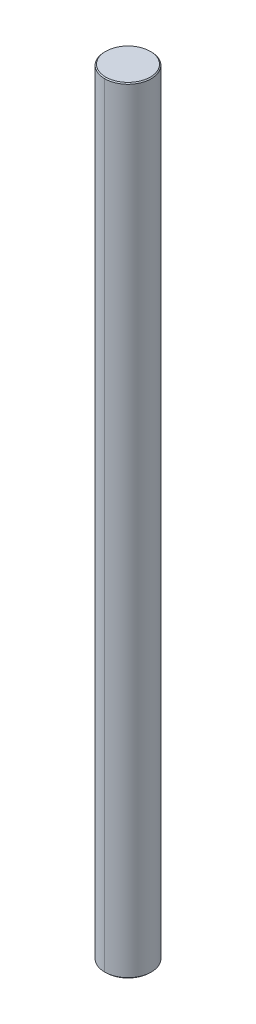
ISO-10303-21;
HEADER;
FILE_DESCRIPTION(('STEP AP214'),'2;1');
FILE_NAME('part.step','',(''),(''),'','','');
FILE_SCHEMA(('AUTOMOTIVE_DESIGN { 1 0 10303 214 1 1 1 1 }'));
ENDSEC;
DATA;
#1=APPLICATION_CONTEXT('core data for automotive mechanical design processes');
#2=APPLICATION_PROTOCOL_DEFINITION('international standard','automotive_design',2000,#1);
#3=PRODUCT_CONTEXT('',#1,'mechanical');
#4=PRODUCT('Part','Part','',(#3));
#5=PRODUCT_RELATED_PRODUCT_CATEGORY('part','',(#4));
#6=PRODUCT_DEFINITION_FORMATION('','',#4);
#7=PRODUCT_DEFINITION_CONTEXT('part definition',#1,'design');
#8=PRODUCT_DEFINITION('design','',#6,#7);
#9=PRODUCT_DEFINITION_SHAPE('','',#8);
#10=(LENGTH_UNIT() NAMED_UNIT(*) SI_UNIT(.MILLI.,.METRE.));
#11=(NAMED_UNIT(*) PLANE_ANGLE_UNIT() SI_UNIT($,.RADIAN.));
#12=(NAMED_UNIT(*) SI_UNIT($,.STERADIAN.) SOLID_ANGLE_UNIT());
#13=UNCERTAINTY_MEASURE_WITH_UNIT(LENGTH_MEASURE(1.E-05),#10,'distance_accuracy_value','');
#14=(GEOMETRIC_REPRESENTATION_CONTEXT(3) GLOBAL_UNCERTAINTY_ASSIGNED_CONTEXT((#13)) GLOBAL_UNIT_ASSIGNED_CONTEXT((#10,
#11,#12)) REPRESENTATION_CONTEXT('',''));
#15=CARTESIAN_POINT('',(0.,0.,0.));
#16=DIRECTION('',(0.,0.,1.));
#17=DIRECTION('',(1.,0.,0.));
#18=AXIS2_PLACEMENT_3D('',#15,#16,#17);
#19=CARTESIAN_POINT('',(0.,100.,0.));
#20=DIRECTION('',(0.,-1.,0.));
#21=DIRECTION('',(0.,0.,-1.));
#22=AXIS2_PLACEMENT_3D('',#19,#20,#21);
#23=CONICAL_SURFACE('',#22,2.875,0.785398163397384);
#24=DIRECTION('',(0.,-0.707106781186593,0.707106781186502));
#25=VECTOR('',#24,1.);
#26=CARTESIAN_POINT('',(0.,100.,2.875));
#27=LINE('',#26,#25);
#28=CARTESIAN_POINT('',(0.,100.,2.875));
#29=VERTEX_POINT('',#28);
#30=CARTESIAN_POINT('',(0.,99.875,3.));
#31=VERTEX_POINT('',#30);
#32=EDGE_CURVE('E69',#29,#31,#27,.T.);
#33=ORIENTED_EDGE('',*,*,#32,.F.);
#34=CARTESIAN_POINT('',(0.,100.,0.));
#35=DIRECTION('',(0.,1.,0.));
#36=DIRECTION('',(0.,0.,1.));
#37=AXIS2_PLACEMENT_3D('',#34,#35,#36);
#38=CIRCLE('',#37,2.875);
#39=CARTESIAN_POINT('',(0.,100.,-2.875));
#40=VERTEX_POINT('',#39);
#41=EDGE_CURVE('E28',#40,#29,#38,.T.);
#42=ORIENTED_EDGE('',*,*,#41,.F.);
#43=DIRECTION('',(0.,-0.707106781186593,-0.707106781186502));
#44=VECTOR('',#43,1.);
#45=CARTESIAN_POINT('',(0.,100.,-2.875));
#46=LINE('',#45,#44);
#47=CARTESIAN_POINT('',(0.,99.875,-3.));
#48=VERTEX_POINT('',#47);
#49=EDGE_CURVE('E66',#40,#48,#46,.T.);
#50=ORIENTED_EDGE('',*,*,#49,.T.);
#51=CARTESIAN_POINT('',(0.,99.875,0.));
#52=DIRECTION('',(0.,-1.,0.));
#53=DIRECTION('',(0.,0.,1.));
#54=AXIS2_PLACEMENT_3D('',#51,#52,#53);
#55=CIRCLE('',#54,3.);
#56=EDGE_CURVE('E101',#31,#48,#55,.T.);
#57=ORIENTED_EDGE('',*,*,#56,.F.);
#58=EDGE_LOOP('',(#33,#42,#50,#57));
#59=FACE_BOUND('',#58,.T.);
#60=ADVANCED_FACE('F17',(#59),#23,.T.);
#61=CARTESIAN_POINT('',(0.,0.124999999999986,0.));
#62=DIRECTION('',(0.,1.,0.));
#63=DIRECTION('',(0.,0.,1.));
#64=AXIS2_PLACEMENT_3D('',#61,#62,#63);
#65=CONICAL_SURFACE('',#64,3.,0.785398163397438);
#66=DIRECTION('',(0.,0.707106781186555,-0.70710678118654));
#67=VECTOR('',#66,1.);
#68=CARTESIAN_POINT('',(0.,0.124999999999986,-3.));
#69=LINE('',#68,#67);
#70=CARTESIAN_POINT('',(0.,0.,-2.875));
#71=VERTEX_POINT('',#70);
#72=CARTESIAN_POINT('',(0.,0.124999999999986,-3.));
#73=VERTEX_POINT('',#72);
#74=EDGE_CURVE('E100',#71,#73,#69,.T.);
#75=ORIENTED_EDGE('',*,*,#74,.F.);
#76=CARTESIAN_POINT('',(0.,0.,0.));
#77=DIRECTION('',(0.,-1.,0.));
#78=DIRECTION('',(0.,0.,1.));
#79=AXIS2_PLACEMENT_3D('',#76,#77,#78);
#80=CIRCLE('',#79,2.875);
#81=CARTESIAN_POINT('',(0.,0.,2.875));
#82=VERTEX_POINT('',#81);
#83=EDGE_CURVE('E11',#82,#71,#80,.T.);
#84=ORIENTED_EDGE('',*,*,#83,.F.);
#85=DIRECTION('',(0.,0.707106781186555,0.70710678118654));
#86=VECTOR('',#85,1.);
#87=CARTESIAN_POINT('',(0.,0.124999999999986,3.));
#88=LINE('',#87,#86);
#89=CARTESIAN_POINT('',(0.,0.124999999999986,3.));
#90=VERTEX_POINT('',#89);
#91=EDGE_CURVE('E99',#82,#90,#88,.T.);
#92=ORIENTED_EDGE('',*,*,#91,.T.);
#93=CARTESIAN_POINT('',(0.,0.124999999999986,0.));
#94=DIRECTION('',(0.,1.,0.));
#95=DIRECTION('',(0.,0.,1.));
#96=AXIS2_PLACEMENT_3D('',#93,#94,#95);
#97=CIRCLE('',#96,3.);
#98=EDGE_CURVE('E21',#73,#90,#97,.T.);
#99=ORIENTED_EDGE('',*,*,#98,.F.);
#100=EDGE_LOOP('',(#75,#84,#92,#99));
#101=FACE_BOUND('',#100,.T.);
#102=ADVANCED_FACE('F139',(#101),#65,.T.);
#103=CARTESIAN_POINT('',(0.,0.,0.));
#104=DIRECTION('',(0.,1.,0.));
#105=DIRECTION('',(1.,0.,0.));
#106=AXIS2_PLACEMENT_3D('',#103,#104,#105);
#107=PLANE('',#106);
#108=ORIENTED_EDGE('',*,*,#83,.T.);
#109=CARTESIAN_POINT('',(0.,0.,0.));
#110=DIRECTION('',(0.,-1.,0.));
#111=DIRECTION('',(0.,0.,1.));
#112=AXIS2_PLACEMENT_3D('',#109,#110,#111);
#113=CIRCLE('',#112,2.875);
#114=EDGE_CURVE('E81',#71,#82,#113,.T.);
#115=ORIENTED_EDGE('',*,*,#114,.T.);
#116=EDGE_LOOP('',(#108,#115));
#117=FACE_BOUND('',#116,.T.);
#118=ADVANCED_FACE('F19',(#117),#107,.F.);
#119=CARTESIAN_POINT('',(0.,100.,0.));
#120=DIRECTION('',(0.,1.,0.));
#121=DIRECTION('',(1.,0.,0.));
#122=AXIS2_PLACEMENT_3D('',#119,#120,#121);
#123=PLANE('',#122);
#124=ORIENTED_EDGE('',*,*,#41,.T.);
#125=CARTESIAN_POINT('',(0.,100.,0.));
#126=DIRECTION('',(0.,1.,0.));
#127=DIRECTION('',(0.,0.,1.));
#128=AXIS2_PLACEMENT_3D('',#125,#126,#127);
#129=CIRCLE('',#128,2.875);
#130=EDGE_CURVE('E77',#29,#40,#129,.T.);
#131=ORIENTED_EDGE('',*,*,#130,.T.);
#132=EDGE_LOOP('',(#124,#131));
#133=FACE_BOUND('',#132,.T.);
#134=ADVANCED_FACE('F83',(#133),#123,.T.);
#135=CARTESIAN_POINT('',(0.,100.,0.));
#136=DIRECTION('',(0.,-1.,0.));
#137=DIRECTION('',(0.,0.,-1.));
#138=AXIS2_PLACEMENT_3D('',#135,#136,#137);
#139=CYLINDRICAL_SURFACE('',#138,3.);
#140=DIRECTION('',(0.,-1.,0.));
#141=VECTOR('',#140,1.);
#142=CARTESIAN_POINT('',(0.,100.,3.));
#143=LINE('',#142,#141);
#144=EDGE_CURVE('E107',#31,#90,#143,.T.);
#145=ORIENTED_EDGE('',*,*,#144,.F.);
#146=ORIENTED_EDGE('',*,*,#56,.T.);
#147=DIRECTION('',(0.,-1.,0.));
#148=VECTOR('',#147,1.);
#149=CARTESIAN_POINT('',(0.,100.,-3.));
#150=LINE('',#149,#148);
#151=EDGE_CURVE('E94',#48,#73,#150,.T.);
#152=ORIENTED_EDGE('',*,*,#151,.T.);
#153=ORIENTED_EDGE('',*,*,#98,.T.);
#154=EDGE_LOOP('',(#145,#146,#152,#153));
#155=FACE_BOUND('',#154,.T.);
#156=ADVANCED_FACE('F132',(#155),#139,.T.);
#157=CARTESIAN_POINT('',(0.,100.,0.));
#158=DIRECTION('',(0.,-1.,0.));
#159=DIRECTION('',(0.,0.,-1.));
#160=AXIS2_PLACEMENT_3D('',#157,#158,#159);
#161=CYLINDRICAL_SURFACE('',#160,3.);
#162=CARTESIAN_POINT('',(0.,99.875,0.));
#163=DIRECTION('',(0.,-1.,0.));
#164=DIRECTION('',(0.,0.,1.));
#165=AXIS2_PLACEMENT_3D('',#162,#163,#164);
#166=CIRCLE('',#165,3.);
#167=EDGE_CURVE('E79',#48,#31,#166,.T.);
#168=ORIENTED_EDGE('',*,*,#167,.T.);
#169=ORIENTED_EDGE('',*,*,#144,.T.);
#170=CARTESIAN_POINT('',(0.,0.124999999999986,0.));
#171=DIRECTION('',(0.,1.,0.));
#172=DIRECTION('',(0.,0.,1.));
#173=AXIS2_PLACEMENT_3D('',#170,#171,#172);
#174=CIRCLE('',#173,3.);
#175=EDGE_CURVE('E96',#90,#73,#174,.T.);
#176=ORIENTED_EDGE('',*,*,#175,.T.);
#177=ORIENTED_EDGE('',*,*,#151,.F.);
#178=EDGE_LOOP('',(#168,#169,#176,#177));
#179=FACE_BOUND('',#178,.T.);
#180=ADVANCED_FACE('F133',(#179),#161,.T.);
#181=CARTESIAN_POINT('',(0.,0.124999999999986,0.));
#182=DIRECTION('',(0.,1.,0.));
#183=DIRECTION('',(0.,0.,1.));
#184=AXIS2_PLACEMENT_3D('',#181,#182,#183);
#185=CONICAL_SURFACE('',#184,3.,0.785398163397438);
#186=ORIENTED_EDGE('',*,*,#114,.F.);
#187=ORIENTED_EDGE('',*,*,#74,.T.);
#188=ORIENTED_EDGE('',*,*,#175,.F.);
#189=ORIENTED_EDGE('',*,*,#91,.F.);
#190=EDGE_LOOP('',(#186,#187,#188,#189));
#191=FACE_BOUND('',#190,.T.);
#192=ADVANCED_FACE('F135',(#191),#185,.T.);
#193=CARTESIAN_POINT('',(0.,100.,0.));
#194=DIRECTION('',(0.,-1.,0.));
#195=DIRECTION('',(0.,0.,-1.));
#196=AXIS2_PLACEMENT_3D('',#193,#194,#195);
#197=CONICAL_SURFACE('',#196,2.875,0.785398163397384);
#198=ORIENTED_EDGE('',*,*,#130,.F.);
#199=ORIENTED_EDGE('',*,*,#32,.T.);
#200=ORIENTED_EDGE('',*,*,#167,.F.);
#201=ORIENTED_EDGE('',*,*,#49,.F.);
#202=EDGE_LOOP('',(#198,#199,#200,#201));
#203=FACE_BOUND('',#202,.T.);
#204=ADVANCED_FACE('F76',(#203),#197,.T.);
#205=CLOSED_SHELL('',(#60,#102,#118,#134,#156,#180,#192,#204));
#206=MANIFOLD_SOLID_BREP('B1',#205);
#207=ADVANCED_BREP_SHAPE_REPRESENTATION('',(#18,#206),#14);
#208=SHAPE_DEFINITION_REPRESENTATION(#9,#207);
ENDSEC;
END-ISO-10303-21;
